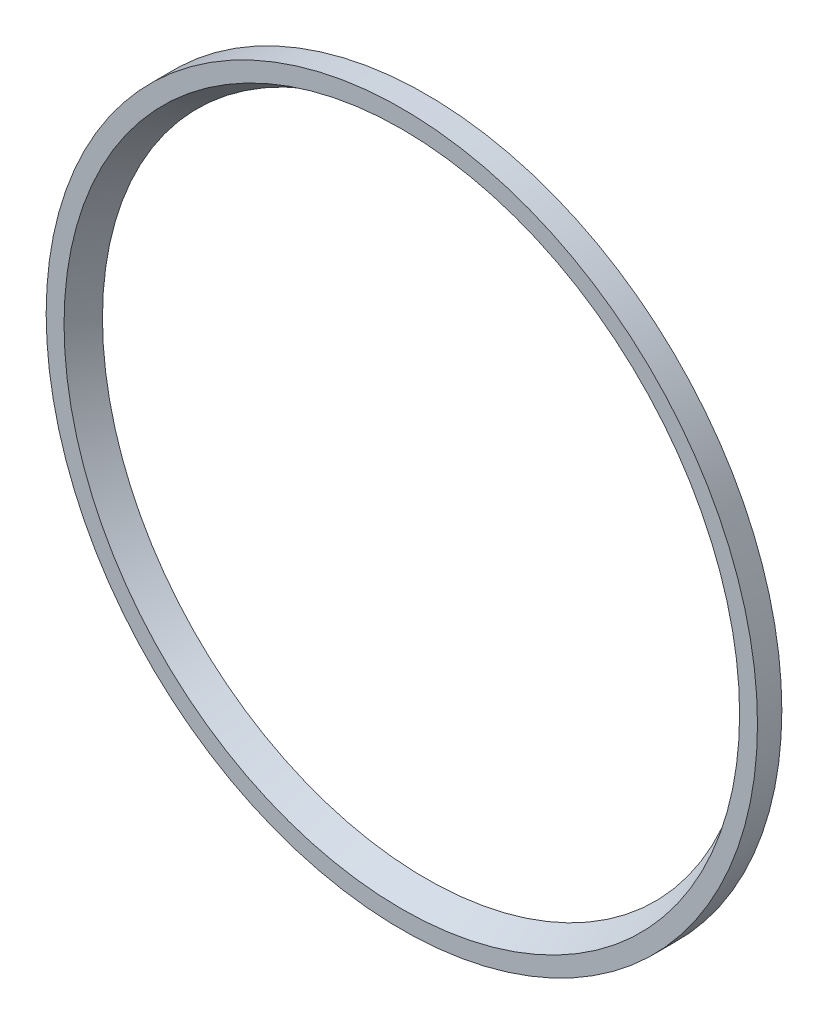
ISO-10303-21;
HEADER;
FILE_DESCRIPTION(('STEP AP214'),'2;1');
FILE_NAME('part.step','',(''),(''),'','','');
FILE_SCHEMA(('AUTOMOTIVE_DESIGN { 1 0 10303 214 1 1 1 1 }'));
ENDSEC;
DATA;
#1=APPLICATION_CONTEXT('core data for automotive mechanical design processes');
#2=APPLICATION_PROTOCOL_DEFINITION('international standard','automotive_design',2000,#1);
#3=PRODUCT_CONTEXT('',#1,'mechanical');
#4=PRODUCT('Part','Part','',(#3));
#5=PRODUCT_RELATED_PRODUCT_CATEGORY('part','',(#4));
#6=PRODUCT_DEFINITION_FORMATION('','',#4);
#7=PRODUCT_DEFINITION_CONTEXT('part definition',#1,'design');
#8=PRODUCT_DEFINITION('design','',#6,#7);
#9=PRODUCT_DEFINITION_SHAPE('','',#8);
#10=(LENGTH_UNIT() NAMED_UNIT(*) SI_UNIT(.MILLI.,.METRE.));
#11=(NAMED_UNIT(*) PLANE_ANGLE_UNIT() SI_UNIT($,.RADIAN.));
#12=(NAMED_UNIT(*) SI_UNIT($,.STERADIAN.) SOLID_ANGLE_UNIT());
#13=UNCERTAINTY_MEASURE_WITH_UNIT(LENGTH_MEASURE(1.E-05),#10,'distance_accuracy_value','');
#14=(GEOMETRIC_REPRESENTATION_CONTEXT(3) GLOBAL_UNCERTAINTY_ASSIGNED_CONTEXT((#13)) GLOBAL_UNIT_ASSIGNED_CONTEXT((#10,
#11,#12)) REPRESENTATION_CONTEXT('',''));
#15=CARTESIAN_POINT('',(0.,0.,0.));
#16=DIRECTION('',(0.,0.,1.));
#17=DIRECTION('',(1.,0.,0.));
#18=AXIS2_PLACEMENT_3D('',#15,#16,#17);
#19=CARTESIAN_POINT('',(0.,0.,1.27));
#20=DIRECTION('',(0.,0.,1.));
#21=DIRECTION('',(1.,0.,0.));
#22=AXIS2_PLACEMENT_3D('',#19,#20,#21);
#23=PLANE('',#22);
#24=CARTESIAN_POINT('',(0.,0.,1.27));
#25=DIRECTION('',(0.,0.,1.));
#26=DIRECTION('',(1.,0.,0.));
#27=AXIS2_PLACEMENT_3D('',#24,#25,#26);
#28=CIRCLE('',#27,17.6098522628063);
#29=CARTESIAN_POINT('',(17.6098522628063,0.,1.27));
#30=VERTEX_POINT('',#29);
#31=EDGE_CURVE('E10',#30,#30,#28,.F.);
#32=ORIENTED_EDGE('',*,*,#31,.T.);
#33=EDGE_LOOP('',(#32));
#34=FACE_BOUND('',#33,.T.);
#35=CARTESIAN_POINT('',(0.,0.,1.27));
#36=DIRECTION('',(0.,0.,1.));
#37=DIRECTION('',(1.,0.,0.));
#38=AXIS2_PLACEMENT_3D('',#35,#36,#37);
#39=CIRCLE('',#38,18.542);
#40=CARTESIAN_POINT('',(18.542,0.,1.27));
#41=VERTEX_POINT('',#40);
#42=EDGE_CURVE('E41',#41,#41,#39,.T.);
#43=ORIENTED_EDGE('',*,*,#42,.T.);
#44=EDGE_LOOP('',(#43));
#45=FACE_BOUND('',#44,.T.);
#46=ADVANCED_FACE('F30',(#34,#45),#23,.T.);
#47=CARTESIAN_POINT('',(0.,0.,0.));
#48=DIRECTION('',(0.,0.,1.));
#49=DIRECTION('',(1.,0.,0.));
#50=AXIS2_PLACEMENT_3D('',#47,#48,#49);
#51=PLANE('',#50);
#52=CARTESIAN_POINT('',(0.,0.,0.));
#53=DIRECTION('',(0.,0.,1.));
#54=DIRECTION('',(1.,0.,0.));
#55=AXIS2_PLACEMENT_3D('',#52,#53,#54);
#56=CIRCLE('',#55,16.8766174209354);
#57=CARTESIAN_POINT('',(16.8766174209354,0.,0.));
#58=VERTEX_POINT('',#57);
#59=EDGE_CURVE('E37',#58,#58,#56,.T.);
#60=ORIENTED_EDGE('',*,*,#59,.T.);
#61=EDGE_LOOP('',(#60));
#62=FACE_BOUND('',#61,.T.);
#63=CARTESIAN_POINT('',(0.,0.,0.));
#64=DIRECTION('',(0.,0.,1.));
#65=DIRECTION('',(1.,0.,0.));
#66=AXIS2_PLACEMENT_3D('',#63,#64,#65);
#67=CIRCLE('',#66,18.542);
#68=CARTESIAN_POINT('',(18.542,0.,0.));
#69=VERTEX_POINT('',#68);
#70=EDGE_CURVE('E45',#69,#69,#67,.T.);
#71=ORIENTED_EDGE('',*,*,#70,.F.);
#72=EDGE_LOOP('',(#71));
#73=FACE_BOUND('',#72,.T.);
#74=ADVANCED_FACE('F53',(#62,#73),#51,.F.);
#75=CARTESIAN_POINT('',(0.,0.,1.27));
#76=DIRECTION('',(0.,0.,-1.));
#77=DIRECTION('',(-1.,0.,0.));
#78=AXIS2_PLACEMENT_3D('',#75,#76,#77);
#79=CYLINDRICAL_SURFACE('',#78,18.542);
#80=ORIENTED_EDGE('',*,*,#42,.F.);
#81=EDGE_LOOP('',(#80));
#82=FACE_BOUND('',#81,.T.);
#83=ORIENTED_EDGE('',*,*,#70,.T.);
#84=EDGE_LOOP('',(#83));
#85=FACE_BOUND('',#84,.T.);
#86=ADVANCED_FACE('F51',(#82,#85),#79,.T.);
#87=CARTESIAN_POINT('',(0.,0.,-0.635000000000007));
#88=DIRECTION('',(0.,0.,1.));
#89=DIRECTION('',(1.,0.,0.));
#90=AXIS2_PLACEMENT_3D('',#87,#88,#89);
#91=CONICAL_SURFACE('',#90,16.51,0.523598775598305);
#92=ORIENTED_EDGE('',*,*,#31,.F.);
#93=EDGE_LOOP('',(#92));
#94=FACE_BOUND('',#93,.T.);
#95=ORIENTED_EDGE('',*,*,#59,.F.);
#96=EDGE_LOOP('',(#95));
#97=FACE_BOUND('',#96,.T.);
#98=ADVANCED_FACE('F32',(#94,#97),#91,.F.);
#99=CLOSED_SHELL('',(#46,#74,#86,#98));
#100=MANIFOLD_SOLID_BREP('B2',#99);
#101=ADVANCED_BREP_SHAPE_REPRESENTATION('',(#18,#100),#14);
#102=SHAPE_DEFINITION_REPRESENTATION(#9,#101);
ENDSEC;
END-ISO-10303-21;
